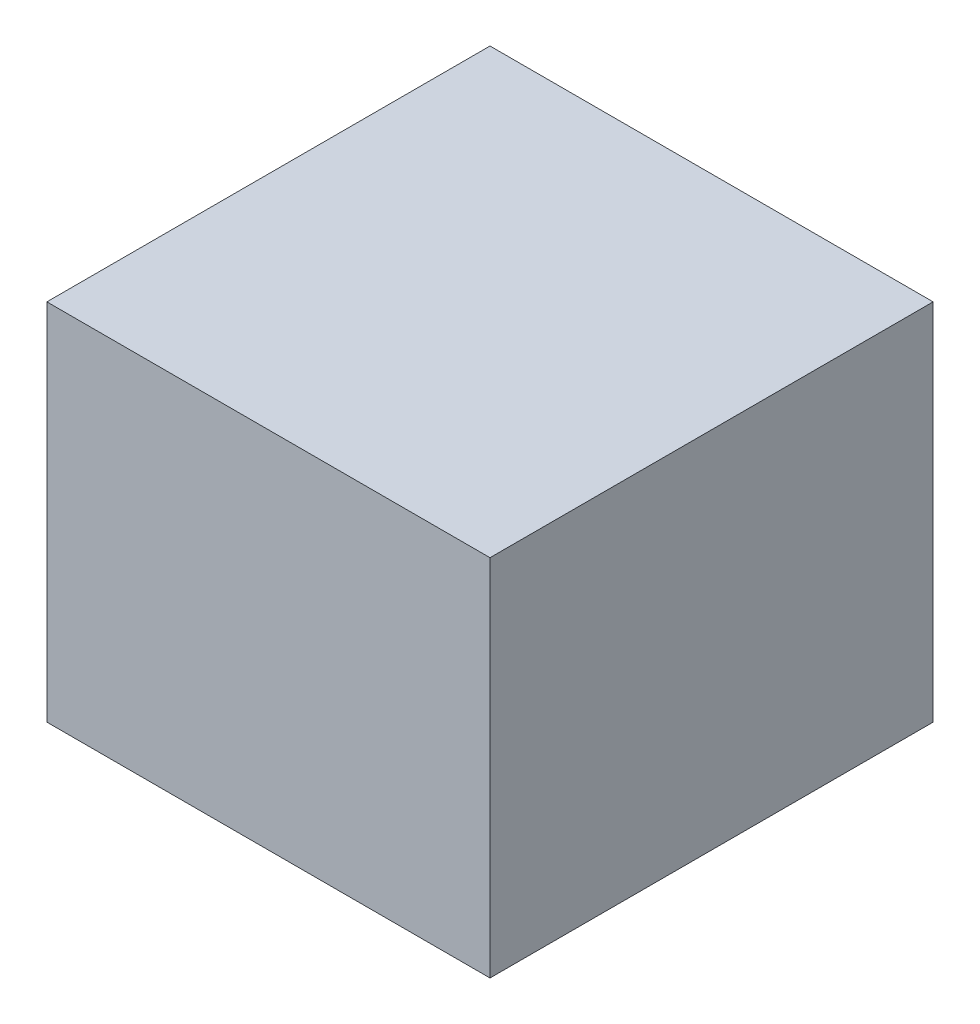
ISO-10303-21;
HEADER;
FILE_DESCRIPTION(('STEP AP214'),'2;1');
FILE_NAME('part.step','',(''),(''),'','','');
FILE_SCHEMA(('AUTOMOTIVE_DESIGN { 1 0 10303 214 1 1 1 1 }'));
ENDSEC;
DATA;
#1=APPLICATION_CONTEXT('core data for automotive mechanical design processes');
#2=APPLICATION_PROTOCOL_DEFINITION('international standard','automotive_design',2000,#1);
#3=PRODUCT_CONTEXT('',#1,'mechanical');
#4=PRODUCT('Part','Part','',(#3));
#5=PRODUCT_RELATED_PRODUCT_CATEGORY('part','',(#4));
#6=PRODUCT_DEFINITION_FORMATION('','',#4);
#7=PRODUCT_DEFINITION_CONTEXT('part definition',#1,'design');
#8=PRODUCT_DEFINITION('design','',#6,#7);
#9=PRODUCT_DEFINITION_SHAPE('','',#8);
#10=(LENGTH_UNIT() NAMED_UNIT(*) SI_UNIT(.MILLI.,.METRE.));
#11=(NAMED_UNIT(*) PLANE_ANGLE_UNIT() SI_UNIT($,.RADIAN.));
#12=(NAMED_UNIT(*) SI_UNIT($,.STERADIAN.) SOLID_ANGLE_UNIT());
#13=UNCERTAINTY_MEASURE_WITH_UNIT(LENGTH_MEASURE(1.E-05),#10,'distance_accuracy_value','');
#14=(GEOMETRIC_REPRESENTATION_CONTEXT(3) GLOBAL_UNCERTAINTY_ASSIGNED_CONTEXT((#13)) GLOBAL_UNIT_ASSIGNED_CONTEXT((#10,
#11,#12)) REPRESENTATION_CONTEXT('',''));
#15=CARTESIAN_POINT('',(0.,0.,0.));
#16=DIRECTION('',(0.,0.,1.));
#17=DIRECTION('',(1.,0.,0.));
#18=AXIS2_PLACEMENT_3D('',#15,#16,#17);
#19=CARTESIAN_POINT('',(70.,115.,-70.));
#20=DIRECTION('',(-1.,0.,0.));
#21=DIRECTION('',(0.,0.,1.));
#22=AXIS2_PLACEMENT_3D('',#19,#20,#21);
#23=PLANE('',#22);
#24=DIRECTION('',(0.,0.,-1.));
#25=VECTOR('',#24,1.);
#26=CARTESIAN_POINT('',(70.,0.,-70.));
#27=LINE('',#26,#25);
#28=CARTESIAN_POINT('',(70.,0.,70.));
#29=VERTEX_POINT('',#28);
#30=CARTESIAN_POINT('',(70.,0.,-70.));
#31=VERTEX_POINT('',#30);
#32=EDGE_CURVE('E107',#29,#31,#27,.T.);
#33=ORIENTED_EDGE('',*,*,#32,.T.);
#34=DIRECTION('',(0.,-1.,0.));
#35=VECTOR('',#34,1.);
#36=CARTESIAN_POINT('',(70.,115.,-70.));
#37=LINE('',#36,#35);
#38=CARTESIAN_POINT('',(70.,115.,-70.));
#39=VERTEX_POINT('',#38);
#40=EDGE_CURVE('E11',#39,#31,#37,.T.);
#41=ORIENTED_EDGE('',*,*,#40,.F.);
#42=DIRECTION('',(0.,0.,-1.));
#43=VECTOR('',#42,1.);
#44=CARTESIAN_POINT('',(70.,115.,-70.));
#45=LINE('',#44,#43);
#46=CARTESIAN_POINT('',(70.,115.,70.));
#47=VERTEX_POINT('',#46);
#48=EDGE_CURVE('E91',#47,#39,#45,.T.);
#49=ORIENTED_EDGE('',*,*,#48,.F.);
#50=DIRECTION('',(0.,-1.,0.));
#51=VECTOR('',#50,1.);
#52=CARTESIAN_POINT('',(70.,115.,70.));
#53=LINE('',#52,#51);
#54=EDGE_CURVE('E103',#47,#29,#53,.T.);
#55=ORIENTED_EDGE('',*,*,#54,.T.);
#56=EDGE_LOOP('',(#33,#41,#49,#55));
#57=FACE_BOUND('',#56,.T.);
#58=ADVANCED_FACE('F39',(#57),#23,.F.);
#59=CARTESIAN_POINT('',(-70.,115.,-70.));
#60=DIRECTION('',(0.,0.,1.));
#61=DIRECTION('',(1.,0.,0.));
#62=AXIS2_PLACEMENT_3D('',#59,#60,#61);
#63=PLANE('',#62);
#64=DIRECTION('',(-1.,0.,0.));
#65=VECTOR('',#64,1.);
#66=CARTESIAN_POINT('',(-70.,0.,-70.));
#67=LINE('',#66,#65);
#68=CARTESIAN_POINT('',(-70.,0.,-70.));
#69=VERTEX_POINT('',#68);
#70=EDGE_CURVE('E96',#31,#69,#67,.T.);
#71=ORIENTED_EDGE('',*,*,#70,.T.);
#72=DIRECTION('',(0.,-1.,0.));
#73=VECTOR('',#72,1.);
#74=CARTESIAN_POINT('',(-70.,115.,-70.));
#75=LINE('',#74,#73);
#76=CARTESIAN_POINT('',(-70.,115.,-70.));
#77=VERTEX_POINT('',#76);
#78=EDGE_CURVE('E48',#77,#69,#75,.T.);
#79=ORIENTED_EDGE('',*,*,#78,.F.);
#80=DIRECTION('',(-1.,0.,0.));
#81=VECTOR('',#80,1.);
#82=CARTESIAN_POINT('',(-70.,115.,-70.));
#83=LINE('',#82,#81);
#84=EDGE_CURVE('E86',#39,#77,#83,.T.);
#85=ORIENTED_EDGE('',*,*,#84,.F.);
#86=ORIENTED_EDGE('',*,*,#40,.T.);
#87=EDGE_LOOP('',(#71,#79,#85,#86));
#88=FACE_BOUND('',#87,.T.);
#89=ADVANCED_FACE('F95',(#88),#63,.F.);
#90=CARTESIAN_POINT('',(-70.,115.,-70.));
#91=DIRECTION('',(1.,0.,0.));
#92=DIRECTION('',(0.,0.,-1.));
#93=AXIS2_PLACEMENT_3D('',#90,#91,#92);
#94=PLANE('',#93);
#95=DIRECTION('',(0.,0.,1.));
#96=VECTOR('',#95,1.);
#97=CARTESIAN_POINT('',(-70.,0.,-70.));
#98=LINE('',#97,#96);
#99=CARTESIAN_POINT('',(-70.,0.,70.));
#100=VERTEX_POINT('',#99);
#101=EDGE_CURVE('E73',#69,#100,#98,.T.);
#102=ORIENTED_EDGE('',*,*,#101,.T.);
#103=DIRECTION('',(0.,-1.,0.));
#104=VECTOR('',#103,1.);
#105=CARTESIAN_POINT('',(-70.,115.,70.));
#106=LINE('',#105,#104);
#107=CARTESIAN_POINT('',(-70.,115.,70.));
#108=VERTEX_POINT('',#107);
#109=EDGE_CURVE('E98',#108,#100,#106,.T.);
#110=ORIENTED_EDGE('',*,*,#109,.F.);
#111=DIRECTION('',(0.,0.,1.));
#112=VECTOR('',#111,1.);
#113=CARTESIAN_POINT('',(-70.,115.,-70.));
#114=LINE('',#113,#112);
#115=EDGE_CURVE('E89',#77,#108,#114,.T.);
#116=ORIENTED_EDGE('',*,*,#115,.F.);
#117=ORIENTED_EDGE('',*,*,#78,.T.);
#118=EDGE_LOOP('',(#102,#110,#116,#117));
#119=FACE_BOUND('',#118,.T.);
#120=ADVANCED_FACE('F99',(#119),#94,.F.);
#121=CARTESIAN_POINT('',(-70.,115.,70.));
#122=DIRECTION('',(0.,0.,-1.));
#123=DIRECTION('',(-1.,0.,0.));
#124=AXIS2_PLACEMENT_3D('',#121,#122,#123);
#125=PLANE('',#124);
#126=DIRECTION('',(1.,0.,0.));
#127=VECTOR('',#126,1.);
#128=CARTESIAN_POINT('',(-70.,0.,70.));
#129=LINE('',#128,#127);
#130=EDGE_CURVE('E79',#100,#29,#129,.T.);
#131=ORIENTED_EDGE('',*,*,#130,.T.);
#132=ORIENTED_EDGE('',*,*,#54,.F.);
#133=DIRECTION('',(1.,0.,0.));
#134=VECTOR('',#133,1.);
#135=CARTESIAN_POINT('',(-70.,115.,70.));
#136=LINE('',#135,#134);
#137=EDGE_CURVE('E56',#108,#47,#136,.T.);
#138=ORIENTED_EDGE('',*,*,#137,.F.);
#139=ORIENTED_EDGE('',*,*,#109,.T.);
#140=EDGE_LOOP('',(#131,#132,#138,#139));
#141=FACE_BOUND('',#140,.T.);
#142=ADVANCED_FACE('F120',(#141),#125,.F.);
#143=CARTESIAN_POINT('',(0.,115.,0.));
#144=DIRECTION('',(0.,1.,0.));
#145=DIRECTION('',(0.,0.,1.));
#146=AXIS2_PLACEMENT_3D('',#143,#144,#145);
#147=PLANE('',#146);
#148=ORIENTED_EDGE('',*,*,#48,.T.);
#149=ORIENTED_EDGE('',*,*,#84,.T.);
#150=ORIENTED_EDGE('',*,*,#115,.T.);
#151=ORIENTED_EDGE('',*,*,#137,.T.);
#152=EDGE_LOOP('',(#148,#149,#150,#151));
#153=FACE_BOUND('',#152,.T.);
#154=ADVANCED_FACE('F87',(#153),#147,.T.);
#155=CARTESIAN_POINT('',(0.,0.,0.));
#156=DIRECTION('',(0.,1.,0.));
#157=DIRECTION('',(0.,0.,1.));
#158=AXIS2_PLACEMENT_3D('',#155,#156,#157);
#159=PLANE('',#158);
#160=ORIENTED_EDGE('',*,*,#32,.F.);
#161=ORIENTED_EDGE('',*,*,#130,.F.);
#162=ORIENTED_EDGE('',*,*,#101,.F.);
#163=ORIENTED_EDGE('',*,*,#70,.F.);
#164=EDGE_LOOP('',(#160,#161,#162,#163));
#165=FACE_BOUND('',#164,.T.);
#166=ADVANCED_FACE('F123',(#165),#159,.F.);
#167=CLOSED_SHELL('',(#58,#89,#120,#142,#154,#166));
#168=MANIFOLD_SOLID_BREP('B2',#167);
#169=ADVANCED_BREP_SHAPE_REPRESENTATION('',(#18,#168),#14);
#170=SHAPE_DEFINITION_REPRESENTATION(#9,#169);
ENDSEC;
END-ISO-10303-21;
